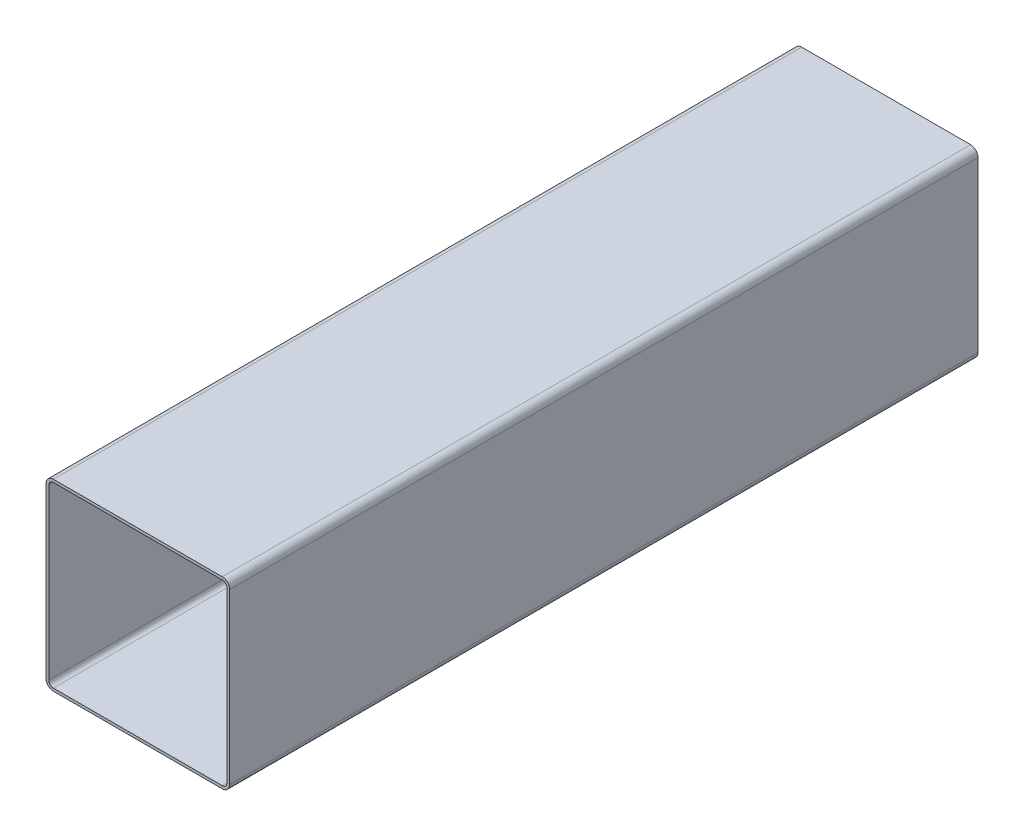
ISO-10303-21;
HEADER;
FILE_DESCRIPTION(('STEP AP214'),'2;1');
FILE_NAME('part.step','',(''),(''),'','','');
FILE_SCHEMA(('AUTOMOTIVE_DESIGN { 1 0 10303 214 1 1 1 1 }'));
ENDSEC;
DATA;
#1=APPLICATION_CONTEXT('core data for automotive mechanical design processes');
#2=APPLICATION_PROTOCOL_DEFINITION('international standard','automotive_design',2000,#1);
#3=PRODUCT_CONTEXT('',#1,'mechanical');
#4=PRODUCT('Part','Part','',(#3));
#5=PRODUCT_RELATED_PRODUCT_CATEGORY('part','',(#4));
#6=PRODUCT_DEFINITION_FORMATION('','',#4);
#7=PRODUCT_DEFINITION_CONTEXT('part definition',#1,'design');
#8=PRODUCT_DEFINITION('design','',#6,#7);
#9=PRODUCT_DEFINITION_SHAPE('','',#8);
#10=(LENGTH_UNIT() NAMED_UNIT(*) SI_UNIT(.MILLI.,.METRE.));
#11=(NAMED_UNIT(*) PLANE_ANGLE_UNIT() SI_UNIT($,.RADIAN.));
#12=(NAMED_UNIT(*) SI_UNIT($,.STERADIAN.) SOLID_ANGLE_UNIT());
#13=UNCERTAINTY_MEASURE_WITH_UNIT(LENGTH_MEASURE(1.E-05),#10,'distance_accuracy_value','');
#14=(GEOMETRIC_REPRESENTATION_CONTEXT(3) GLOBAL_UNCERTAINTY_ASSIGNED_CONTEXT((#13)) GLOBAL_UNIT_ASSIGNED_CONTEXT((#10,
#11,#12)) REPRESENTATION_CONTEXT('',''));
#15=CARTESIAN_POINT('',(0.,0.,0.));
#16=DIRECTION('',(0.,0.,1.));
#17=DIRECTION('',(1.,0.,0.));
#18=AXIS2_PLACEMENT_3D('',#15,#16,#17);
#19=CARTESIAN_POINT('',(-92.,-92.,815.));
#20=DIRECTION('',(0.,0.,1.));
#21=DIRECTION('',(1.,0.,0.));
#22=AXIS2_PLACEMENT_3D('',#19,#20,#21);
#23=PLANE('',#22);
#24=CARTESIAN_POINT('',(-92.,-92.,815.));
#25=DIRECTION('',(0.,0.,1.));
#26=DIRECTION('',(1.,0.,0.));
#27=AXIS2_PLACEMENT_3D('',#24,#25,#26);
#28=CIRCLE('',#27,8.00000000000001);
#29=CARTESIAN_POINT('',(-100.,-92.,815.));
#30=VERTEX_POINT('',#29);
#31=CARTESIAN_POINT('',(-92.,-100.,815.));
#32=VERTEX_POINT('',#31);
#33=EDGE_CURVE('E261',#30,#32,#28,.T.);
#34=ORIENTED_EDGE('',*,*,#33,.T.);
#35=DIRECTION('',(1.,0.,0.));
#36=VECTOR('',#35,1.);
#37=CARTESIAN_POINT('',(92.,-100.,815.));
#38=LINE('',#37,#36);
#39=CARTESIAN_POINT('',(92.,-100.,815.));
#40=VERTEX_POINT('',#39);
#41=EDGE_CURVE('E264',#32,#40,#38,.T.);
#42=ORIENTED_EDGE('',*,*,#41,.T.);
#43=CARTESIAN_POINT('',(92.,-92.,815.));
#44=DIRECTION('',(0.,0.,1.));
#45=DIRECTION('',(1.,0.,0.));
#46=AXIS2_PLACEMENT_3D('',#43,#44,#45);
#47=CIRCLE('',#46,7.99999999999999);
#48=CARTESIAN_POINT('',(100.,-92.,815.));
#49=VERTEX_POINT('',#48);
#50=EDGE_CURVE('E267',#40,#49,#47,.T.);
#51=ORIENTED_EDGE('',*,*,#50,.T.);
#52=DIRECTION('',(0.,1.,0.));
#53=VECTOR('',#52,1.);
#54=CARTESIAN_POINT('',(100.,-92.,815.));
#55=LINE('',#54,#53);
#56=CARTESIAN_POINT('',(100.,92.,815.));
#57=VERTEX_POINT('',#56);
#58=EDGE_CURVE('E269',#49,#57,#55,.T.);
#59=ORIENTED_EDGE('',*,*,#58,.T.);
#60=CARTESIAN_POINT('',(92.,92.,815.));
#61=DIRECTION('',(0.,0.,1.));
#62=DIRECTION('',(1.,0.,0.));
#63=AXIS2_PLACEMENT_3D('',#60,#61,#62);
#64=CIRCLE('',#63,8.00000000000001);
#65=CARTESIAN_POINT('',(92.,100.,815.));
#66=VERTEX_POINT('',#65);
#67=EDGE_CURVE('E271',#57,#66,#64,.T.);
#68=ORIENTED_EDGE('',*,*,#67,.T.);
#69=DIRECTION('',(-1.,0.,0.));
#70=VECTOR('',#69,1.);
#71=CARTESIAN_POINT('',(92.,100.,815.));
#72=LINE('',#71,#70);
#73=CARTESIAN_POINT('',(-92.,100.,815.));
#74=VERTEX_POINT('',#73);
#75=EDGE_CURVE('E273',#66,#74,#72,.T.);
#76=ORIENTED_EDGE('',*,*,#75,.T.);
#77=CARTESIAN_POINT('',(-92.,92.,815.));
#78=DIRECTION('',(0.,0.,1.));
#79=DIRECTION('',(-1.,0.,0.));
#80=AXIS2_PLACEMENT_3D('',#77,#78,#79);
#81=CIRCLE('',#80,8.);
#82=CARTESIAN_POINT('',(-100.,92.,815.));
#83=VERTEX_POINT('',#82);
#84=EDGE_CURVE('E275',#74,#83,#81,.T.);
#85=ORIENTED_EDGE('',*,*,#84,.T.);
#86=DIRECTION('',(0.,-1.,0.));
#87=VECTOR('',#86,1.);
#88=CARTESIAN_POINT('',(-100.,-92.,815.));
#89=LINE('',#88,#87);
#90=EDGE_CURVE('E277',#83,#30,#89,.T.);
#91=ORIENTED_EDGE('',*,*,#90,.T.);
#92=EDGE_LOOP('',(#34,#42,#51,#59,#68,#76,#85,#91));
#93=FACE_BOUND('',#92,.T.);
#94=DIRECTION('',(1.,0.,0.));
#95=VECTOR('',#94,1.);
#96=CARTESIAN_POINT('',(92.,-97.,815.));
#97=LINE('',#96,#95);
#98=CARTESIAN_POINT('',(-92.,-97.,815.));
#99=VERTEX_POINT('',#98);
#100=CARTESIAN_POINT('',(92.,-97.,815.));
#101=VERTEX_POINT('',#100);
#102=EDGE_CURVE('E204',#99,#101,#97,.T.);
#103=ORIENTED_EDGE('',*,*,#102,.F.);
#104=CARTESIAN_POINT('',(-92.,-92.,815.));
#105=DIRECTION('',(0.,0.,1.));
#106=DIRECTION('',(1.,0.,0.));
#107=AXIS2_PLACEMENT_3D('',#104,#105,#106);
#108=CIRCLE('',#107,5.00000000000001);
#109=CARTESIAN_POINT('',(-97.,-92.,815.));
#110=VERTEX_POINT('',#109);
#111=EDGE_CURVE('E196',#110,#99,#108,.T.);
#112=ORIENTED_EDGE('',*,*,#111,.F.);
#113=DIRECTION('',(0.,-1.,0.));
#114=VECTOR('',#113,1.);
#115=CARTESIAN_POINT('',(-97.,-92.,815.));
#116=LINE('',#115,#114);
#117=CARTESIAN_POINT('',(-97.,92.,815.));
#118=VERTEX_POINT('',#117);
#119=EDGE_CURVE('E229',#118,#110,#116,.T.);
#120=ORIENTED_EDGE('',*,*,#119,.F.);
#121=CARTESIAN_POINT('',(-92.,92.,815.));
#122=DIRECTION('',(0.,0.,1.));
#123=DIRECTION('',(1.,0.,0.));
#124=AXIS2_PLACEMENT_3D('',#121,#122,#123);
#125=CIRCLE('',#124,5.);
#126=CARTESIAN_POINT('',(-92.,97.,815.));
#127=VERTEX_POINT('',#126);
#128=EDGE_CURVE('E227',#127,#118,#125,.T.);
#129=ORIENTED_EDGE('',*,*,#128,.F.);
#130=DIRECTION('',(-1.,0.,0.));
#131=VECTOR('',#130,1.);
#132=CARTESIAN_POINT('',(92.,97.,815.));
#133=LINE('',#132,#131);
#134=CARTESIAN_POINT('',(92.,97.,815.));
#135=VERTEX_POINT('',#134);
#136=EDGE_CURVE('E225',#135,#127,#133,.T.);
#137=ORIENTED_EDGE('',*,*,#136,.F.);
#138=CARTESIAN_POINT('',(92.,92.,815.));
#139=DIRECTION('',(0.,0.,1.));
#140=DIRECTION('',(1.,0.,0.));
#141=AXIS2_PLACEMENT_3D('',#138,#139,#140);
#142=CIRCLE('',#141,5.00000000000001);
#143=CARTESIAN_POINT('',(97.,92.,815.));
#144=VERTEX_POINT('',#143);
#145=EDGE_CURVE('E223',#144,#135,#142,.T.);
#146=ORIENTED_EDGE('',*,*,#145,.F.);
#147=DIRECTION('',(0.,1.,0.));
#148=VECTOR('',#147,1.);
#149=CARTESIAN_POINT('',(97.,-92.,815.));
#150=LINE('',#149,#148);
#151=CARTESIAN_POINT('',(97.,-92.,815.));
#152=VERTEX_POINT('',#151);
#153=EDGE_CURVE('E219',#152,#144,#150,.T.);
#154=ORIENTED_EDGE('',*,*,#153,.F.);
#155=CARTESIAN_POINT('',(92.,-92.,815.));
#156=DIRECTION('',(0.,0.,1.));
#157=DIRECTION('',(1.,0.,0.));
#158=AXIS2_PLACEMENT_3D('',#155,#156,#157);
#159=CIRCLE('',#158,4.99999999999999);
#160=EDGE_CURVE('E217',#101,#152,#159,.T.);
#161=ORIENTED_EDGE('',*,*,#160,.F.);
#162=EDGE_LOOP('',(#103,#112,#120,#129,#137,#146,#154,#161));
#163=FACE_BOUND('',#162,.T.);
#164=ADVANCED_FACE('F83',(#93,#163),#23,.T.);
#165=CARTESIAN_POINT('',(-92.,-92.,0.));
#166=DIRECTION('',(0.,0.,1.));
#167=DIRECTION('',(1.,0.,0.));
#168=AXIS2_PLACEMENT_3D('',#165,#166,#167);
#169=PLANE('',#168);
#170=CARTESIAN_POINT('',(-92.,-92.,0.));
#171=DIRECTION('',(0.,0.,1.));
#172=DIRECTION('',(1.,0.,0.));
#173=AXIS2_PLACEMENT_3D('',#170,#171,#172);
#174=CIRCLE('',#173,8.00000000000001);
#175=CARTESIAN_POINT('',(-100.,-92.,0.));
#176=VERTEX_POINT('',#175);
#177=CARTESIAN_POINT('',(-92.,-100.,0.));
#178=VERTEX_POINT('',#177);
#179=EDGE_CURVE('E212',#176,#178,#174,.T.);
#180=ORIENTED_EDGE('',*,*,#179,.F.);
#181=DIRECTION('',(0.,-1.,0.));
#182=VECTOR('',#181,1.);
#183=CARTESIAN_POINT('',(-100.,-92.,0.));
#184=LINE('',#183,#182);
#185=CARTESIAN_POINT('',(-100.,92.,0.));
#186=VERTEX_POINT('',#185);
#187=EDGE_CURVE('E265',#186,#176,#184,.T.);
#188=ORIENTED_EDGE('',*,*,#187,.F.);
#189=CARTESIAN_POINT('',(-92.,92.,0.));
#190=DIRECTION('',(0.,0.,1.));
#191=DIRECTION('',(-1.,0.,0.));
#192=AXIS2_PLACEMENT_3D('',#189,#190,#191);
#193=CIRCLE('',#192,8.);
#194=CARTESIAN_POINT('',(-92.,100.,0.));
#195=VERTEX_POINT('',#194);
#196=EDGE_CURVE('E292',#195,#186,#193,.T.);
#197=ORIENTED_EDGE('',*,*,#196,.F.);
#198=DIRECTION('',(-1.,0.,0.));
#199=VECTOR('',#198,1.);
#200=CARTESIAN_POINT('',(92.,100.,0.));
#201=LINE('',#200,#199);
#202=CARTESIAN_POINT('',(92.,100.,0.));
#203=VERTEX_POINT('',#202);
#204=EDGE_CURVE('E290',#203,#195,#201,.T.);
#205=ORIENTED_EDGE('',*,*,#204,.F.);
#206=CARTESIAN_POINT('',(92.,92.,0.));
#207=DIRECTION('',(0.,0.,1.));
#208=DIRECTION('',(1.,0.,0.));
#209=AXIS2_PLACEMENT_3D('',#206,#207,#208);
#210=CIRCLE('',#209,8.00000000000001);
#211=CARTESIAN_POINT('',(100.,92.,0.));
#212=VERTEX_POINT('',#211);
#213=EDGE_CURVE('E288',#212,#203,#210,.T.);
#214=ORIENTED_EDGE('',*,*,#213,.F.);
#215=DIRECTION('',(0.,1.,0.));
#216=VECTOR('',#215,1.);
#217=CARTESIAN_POINT('',(100.,-92.,0.));
#218=LINE('',#217,#216);
#219=CARTESIAN_POINT('',(100.,-92.,0.));
#220=VERTEX_POINT('',#219);
#221=EDGE_CURVE('E286',#220,#212,#218,.T.);
#222=ORIENTED_EDGE('',*,*,#221,.F.);
#223=CARTESIAN_POINT('',(92.,-92.,0.));
#224=DIRECTION('',(0.,0.,1.));
#225=DIRECTION('',(1.,0.,0.));
#226=AXIS2_PLACEMENT_3D('',#223,#224,#225);
#227=CIRCLE('',#226,7.99999999999999);
#228=CARTESIAN_POINT('',(92.,-100.,0.));
#229=VERTEX_POINT('',#228);
#230=EDGE_CURVE('E284',#229,#220,#227,.T.);
#231=ORIENTED_EDGE('',*,*,#230,.F.);
#232=DIRECTION('',(1.,0.,0.));
#233=VECTOR('',#232,1.);
#234=CARTESIAN_POINT('',(92.,-100.,0.));
#235=LINE('',#234,#233);
#236=EDGE_CURVE('E282',#178,#229,#235,.T.);
#237=ORIENTED_EDGE('',*,*,#236,.F.);
#238=EDGE_LOOP('',(#180,#188,#197,#205,#214,#222,#231,#237));
#239=FACE_BOUND('',#238,.T.);
#240=CARTESIAN_POINT('',(-92.,-92.,0.));
#241=DIRECTION('',(0.,0.,1.));
#242=DIRECTION('',(1.,0.,0.));
#243=AXIS2_PLACEMENT_3D('',#240,#241,#242);
#244=CIRCLE('',#243,5.00000000000001);
#245=CARTESIAN_POINT('',(-97.,-92.,0.));
#246=VERTEX_POINT('',#245);
#247=CARTESIAN_POINT('',(-92.,-97.,0.));
#248=VERTEX_POINT('',#247);
#249=EDGE_CURVE('E106',#246,#248,#244,.T.);
#250=ORIENTED_EDGE('',*,*,#249,.T.);
#251=DIRECTION('',(1.,0.,0.));
#252=VECTOR('',#251,1.);
#253=CARTESIAN_POINT('',(92.,-97.,0.));
#254=LINE('',#253,#252);
#255=CARTESIAN_POINT('',(92.,-97.,0.));
#256=VERTEX_POINT('',#255);
#257=EDGE_CURVE('E211',#248,#256,#254,.T.);
#258=ORIENTED_EDGE('',*,*,#257,.T.);
#259=CARTESIAN_POINT('',(92.,-92.,0.));
#260=DIRECTION('',(0.,0.,1.));
#261=DIRECTION('',(1.,0.,0.));
#262=AXIS2_PLACEMENT_3D('',#259,#260,#261);
#263=CIRCLE('',#262,4.99999999999999);
#264=CARTESIAN_POINT('',(97.,-92.,0.));
#265=VERTEX_POINT('',#264);
#266=EDGE_CURVE('E233',#256,#265,#263,.T.);
#267=ORIENTED_EDGE('',*,*,#266,.T.);
#268=DIRECTION('',(0.,1.,0.));
#269=VECTOR('',#268,1.);
#270=CARTESIAN_POINT('',(97.,-92.,0.));
#271=LINE('',#270,#269);
#272=CARTESIAN_POINT('',(97.,92.,0.));
#273=VERTEX_POINT('',#272);
#274=EDGE_CURVE('E236',#265,#273,#271,.T.);
#275=ORIENTED_EDGE('',*,*,#274,.T.);
#276=CARTESIAN_POINT('',(92.,92.,0.));
#277=DIRECTION('',(0.,0.,1.));
#278=DIRECTION('',(1.,0.,0.));
#279=AXIS2_PLACEMENT_3D('',#276,#277,#278);
#280=CIRCLE('',#279,5.00000000000001);
#281=CARTESIAN_POINT('',(92.,97.,0.));
#282=VERTEX_POINT('',#281);
#283=EDGE_CURVE('E239',#273,#282,#280,.T.);
#284=ORIENTED_EDGE('',*,*,#283,.T.);
#285=DIRECTION('',(-1.,0.,0.));
#286=VECTOR('',#285,1.);
#287=CARTESIAN_POINT('',(92.,97.,0.));
#288=LINE('',#287,#286);
#289=CARTESIAN_POINT('',(-92.,97.,0.));
#290=VERTEX_POINT('',#289);
#291=EDGE_CURVE('E242',#282,#290,#288,.T.);
#292=ORIENTED_EDGE('',*,*,#291,.T.);
#293=CARTESIAN_POINT('',(-92.,92.,0.));
#294=DIRECTION('',(0.,0.,1.));
#295=DIRECTION('',(1.,0.,0.));
#296=AXIS2_PLACEMENT_3D('',#293,#294,#295);
#297=CIRCLE('',#296,5.);
#298=CARTESIAN_POINT('',(-97.,92.,0.));
#299=VERTEX_POINT('',#298);
#300=EDGE_CURVE('E245',#290,#299,#297,.T.);
#301=ORIENTED_EDGE('',*,*,#300,.T.);
#302=DIRECTION('',(0.,-1.,0.));
#303=VECTOR('',#302,1.);
#304=CARTESIAN_POINT('',(-97.,-92.,0.));
#305=LINE('',#304,#303);
#306=EDGE_CURVE('E205',#299,#246,#305,.T.);
#307=ORIENTED_EDGE('',*,*,#306,.T.);
#308=EDGE_LOOP('',(#250,#258,#267,#275,#284,#292,#301,#307));
#309=FACE_BOUND('',#308,.T.);
#310=ADVANCED_FACE('F322',(#239,#309),#169,.F.);
#311=CARTESIAN_POINT('',(-92.,-92.,815.));
#312=DIRECTION('',(0.,0.,-1.));
#313=DIRECTION('',(-1.,0.,0.));
#314=AXIS2_PLACEMENT_3D('',#311,#312,#313);
#315=CYLINDRICAL_SURFACE('',#314,8.00000000000001);
#316=ORIENTED_EDGE('',*,*,#179,.T.);
#317=DIRECTION('',(0.,0.,-1.));
#318=VECTOR('',#317,1.);
#319=CARTESIAN_POINT('',(-92.,-100.,815.));
#320=LINE('',#319,#318);
#321=EDGE_CURVE('E12',#32,#178,#320,.T.);
#322=ORIENTED_EDGE('',*,*,#321,.F.);
#323=ORIENTED_EDGE('',*,*,#33,.F.);
#324=DIRECTION('',(0.,0.,-1.));
#325=VECTOR('',#324,1.);
#326=CARTESIAN_POINT('',(-100.,-92.,815.));
#327=LINE('',#326,#325);
#328=EDGE_CURVE('E279',#30,#176,#327,.T.);
#329=ORIENTED_EDGE('',*,*,#328,.T.);
#330=EDGE_LOOP('',(#316,#322,#323,#329));
#331=FACE_BOUND('',#330,.T.);
#332=ADVANCED_FACE('F85',(#331),#315,.T.);
#333=CARTESIAN_POINT('',(92.,-100.,815.));
#334=DIRECTION('',(0.,1.,0.));
#335=DIRECTION('',(-1.,0.,0.));
#336=AXIS2_PLACEMENT_3D('',#333,#334,#335);
#337=PLANE('',#336);
#338=ORIENTED_EDGE('',*,*,#236,.T.);
#339=DIRECTION('',(0.,0.,-1.));
#340=VECTOR('',#339,1.);
#341=CARTESIAN_POINT('',(92.,-100.,815.));
#342=LINE('',#341,#340);
#343=EDGE_CURVE('E91',#40,#229,#342,.T.);
#344=ORIENTED_EDGE('',*,*,#343,.F.);
#345=ORIENTED_EDGE('',*,*,#41,.F.);
#346=ORIENTED_EDGE('',*,*,#321,.T.);
#347=EDGE_LOOP('',(#338,#344,#345,#346));
#348=FACE_BOUND('',#347,.T.);
#349=ADVANCED_FACE('F339',(#348),#337,.F.);
#350=CARTESIAN_POINT('',(92.,-92.,815.));
#351=DIRECTION('',(0.,0.,-1.));
#352=DIRECTION('',(-1.,0.,0.));
#353=AXIS2_PLACEMENT_3D('',#350,#351,#352);
#354=CYLINDRICAL_SURFACE('',#353,7.99999999999999);
#355=ORIENTED_EDGE('',*,*,#230,.T.);
#356=DIRECTION('',(0.,0.,-1.));
#357=VECTOR('',#356,1.);
#358=CARTESIAN_POINT('',(100.,-92.,815.));
#359=LINE('',#358,#357);
#360=EDGE_CURVE('E309',#49,#220,#359,.T.);
#361=ORIENTED_EDGE('',*,*,#360,.F.);
#362=ORIENTED_EDGE('',*,*,#50,.F.);
#363=ORIENTED_EDGE('',*,*,#343,.T.);
#364=EDGE_LOOP('',(#355,#361,#362,#363));
#365=FACE_BOUND('',#364,.T.);
#366=ADVANCED_FACE('F316',(#365),#354,.T.);
#367=CARTESIAN_POINT('',(100.,-92.,815.));
#368=DIRECTION('',(-1.,0.,0.));
#369=DIRECTION('',(0.,0.,1.));
#370=AXIS2_PLACEMENT_3D('',#367,#368,#369);
#371=PLANE('',#370);
#372=ORIENTED_EDGE('',*,*,#221,.T.);
#373=DIRECTION('',(0.,0.,-1.));
#374=VECTOR('',#373,1.);
#375=CARTESIAN_POINT('',(100.,92.,815.));
#376=LINE('',#375,#374);
#377=EDGE_CURVE('E306',#57,#212,#376,.T.);
#378=ORIENTED_EDGE('',*,*,#377,.F.);
#379=ORIENTED_EDGE('',*,*,#58,.F.);
#380=ORIENTED_EDGE('',*,*,#360,.T.);
#381=EDGE_LOOP('',(#372,#378,#379,#380));
#382=FACE_BOUND('',#381,.T.);
#383=ADVANCED_FACE('F328',(#382),#371,.F.);
#384=CARTESIAN_POINT('',(92.,92.,815.));
#385=DIRECTION('',(0.,0.,-1.));
#386=DIRECTION('',(-1.,0.,0.));
#387=AXIS2_PLACEMENT_3D('',#384,#385,#386);
#388=CYLINDRICAL_SURFACE('',#387,8.00000000000001);
#389=ORIENTED_EDGE('',*,*,#213,.T.);
#390=DIRECTION('',(0.,0.,-1.));
#391=VECTOR('',#390,1.);
#392=CARTESIAN_POINT('',(92.,100.,815.));
#393=LINE('',#392,#391);
#394=EDGE_CURVE('E303',#66,#203,#393,.T.);
#395=ORIENTED_EDGE('',*,*,#394,.F.);
#396=ORIENTED_EDGE('',*,*,#67,.F.);
#397=ORIENTED_EDGE('',*,*,#377,.T.);
#398=EDGE_LOOP('',(#389,#395,#396,#397));
#399=FACE_BOUND('',#398,.T.);
#400=ADVANCED_FACE('F332',(#399),#388,.T.);
#401=CARTESIAN_POINT('',(92.,100.,815.));
#402=DIRECTION('',(0.,-1.,0.));
#403=DIRECTION('',(1.,0.,0.));
#404=AXIS2_PLACEMENT_3D('',#401,#402,#403);
#405=PLANE('',#404);
#406=ORIENTED_EDGE('',*,*,#204,.T.);
#407=DIRECTION('',(0.,0.,-1.));
#408=VECTOR('',#407,1.);
#409=CARTESIAN_POINT('',(-92.,100.,815.));
#410=LINE('',#409,#408);
#411=EDGE_CURVE('E300',#74,#195,#410,.T.);
#412=ORIENTED_EDGE('',*,*,#411,.F.);
#413=ORIENTED_EDGE('',*,*,#75,.F.);
#414=ORIENTED_EDGE('',*,*,#394,.T.);
#415=EDGE_LOOP('',(#406,#412,#413,#414));
#416=FACE_BOUND('',#415,.T.);
#417=ADVANCED_FACE('F352',(#416),#405,.F.);
#418=CARTESIAN_POINT('',(-92.,92.,815.));
#419=DIRECTION('',(0.,0.,-1.));
#420=DIRECTION('',(-1.,0.,0.));
#421=AXIS2_PLACEMENT_3D('',#418,#419,#420);
#422=CYLINDRICAL_SURFACE('',#421,8.);
#423=ORIENTED_EDGE('',*,*,#196,.T.);
#424=DIRECTION('',(0.,0.,-1.));
#425=VECTOR('',#424,1.);
#426=CARTESIAN_POINT('',(-100.,92.,815.));
#427=LINE('',#426,#425);
#428=EDGE_CURVE('E297',#83,#186,#427,.T.);
#429=ORIENTED_EDGE('',*,*,#428,.F.);
#430=ORIENTED_EDGE('',*,*,#84,.F.);
#431=ORIENTED_EDGE('',*,*,#411,.T.);
#432=EDGE_LOOP('',(#423,#429,#430,#431));
#433=FACE_BOUND('',#432,.T.);
#434=ADVANCED_FACE('F350',(#433),#422,.T.);
#435=CARTESIAN_POINT('',(-100.,-92.,815.));
#436=DIRECTION('',(1.,0.,0.));
#437=DIRECTION('',(0.,1.,0.));
#438=AXIS2_PLACEMENT_3D('',#435,#436,#437);
#439=PLANE('',#438);
#440=ORIENTED_EDGE('',*,*,#187,.T.);
#441=ORIENTED_EDGE('',*,*,#328,.F.);
#442=ORIENTED_EDGE('',*,*,#90,.F.);
#443=ORIENTED_EDGE('',*,*,#428,.T.);
#444=EDGE_LOOP('',(#440,#441,#442,#443));
#445=FACE_BOUND('',#444,.T.);
#446=ADVANCED_FACE('F345',(#445),#439,.F.);
#447=CARTESIAN_POINT('',(-92.,-92.,815.));
#448=DIRECTION('',(0.,0.,-1.));
#449=DIRECTION('',(-1.,0.,0.));
#450=AXIS2_PLACEMENT_3D('',#447,#448,#449);
#451=CYLINDRICAL_SURFACE('',#450,5.00000000000001);
#452=ORIENTED_EDGE('',*,*,#249,.F.);
#453=DIRECTION('',(0.,0.,-1.));
#454=VECTOR('',#453,1.);
#455=CARTESIAN_POINT('',(-97.,-92.,815.));
#456=LINE('',#455,#454);
#457=EDGE_CURVE('E200',#110,#246,#456,.T.);
#458=ORIENTED_EDGE('',*,*,#457,.F.);
#459=ORIENTED_EDGE('',*,*,#111,.T.);
#460=DIRECTION('',(0.,0.,-1.));
#461=VECTOR('',#460,1.);
#462=CARTESIAN_POINT('',(-92.,-97.,815.));
#463=LINE('',#462,#461);
#464=EDGE_CURVE('E199',#99,#248,#463,.T.);
#465=ORIENTED_EDGE('',*,*,#464,.T.);
#466=EDGE_LOOP('',(#452,#458,#459,#465));
#467=FACE_BOUND('',#466,.T.);
#468=ADVANCED_FACE('F198',(#467),#451,.F.);
#469=CARTESIAN_POINT('',(92.,-97.,815.));
#470=DIRECTION('',(0.,1.,0.));
#471=DIRECTION('',(-1.,0.,0.));
#472=AXIS2_PLACEMENT_3D('',#469,#470,#471);
#473=PLANE('',#472);
#474=ORIENTED_EDGE('',*,*,#257,.F.);
#475=ORIENTED_EDGE('',*,*,#464,.F.);
#476=ORIENTED_EDGE('',*,*,#102,.T.);
#477=DIRECTION('',(0.,0.,-1.));
#478=VECTOR('',#477,1.);
#479=CARTESIAN_POINT('',(92.,-97.,815.));
#480=LINE('',#479,#478);
#481=EDGE_CURVE('E213',#101,#256,#480,.T.);
#482=ORIENTED_EDGE('',*,*,#481,.T.);
#483=EDGE_LOOP('',(#474,#475,#476,#482));
#484=FACE_BOUND('',#483,.T.);
#485=ADVANCED_FACE('F208',(#484),#473,.T.);
#486=CARTESIAN_POINT('',(92.,-92.,815.));
#487=DIRECTION('',(0.,0.,-1.));
#488=DIRECTION('',(-1.,0.,0.));
#489=AXIS2_PLACEMENT_3D('',#486,#487,#488);
#490=CYLINDRICAL_SURFACE('',#489,4.99999999999999);
#491=ORIENTED_EDGE('',*,*,#266,.F.);
#492=ORIENTED_EDGE('',*,*,#481,.F.);
#493=ORIENTED_EDGE('',*,*,#160,.T.);
#494=DIRECTION('',(0.,0.,-1.));
#495=VECTOR('',#494,1.);
#496=CARTESIAN_POINT('',(97.,-92.,815.));
#497=LINE('',#496,#495);
#498=EDGE_CURVE('E258',#152,#265,#497,.T.);
#499=ORIENTED_EDGE('',*,*,#498,.T.);
#500=EDGE_LOOP('',(#491,#492,#493,#499));
#501=FACE_BOUND('',#500,.T.);
#502=ADVANCED_FACE('F377',(#501),#490,.F.);
#503=CARTESIAN_POINT('',(97.,-92.,815.));
#504=DIRECTION('',(-1.,0.,0.));
#505=DIRECTION('',(0.,0.,1.));
#506=AXIS2_PLACEMENT_3D('',#503,#504,#505);
#507=PLANE('',#506);
#508=ORIENTED_EDGE('',*,*,#274,.F.);
#509=ORIENTED_EDGE('',*,*,#498,.F.);
#510=ORIENTED_EDGE('',*,*,#153,.T.);
#511=DIRECTION('',(0.,0.,-1.));
#512=VECTOR('',#511,1.);
#513=CARTESIAN_POINT('',(97.,92.,815.));
#514=LINE('',#513,#512);
#515=EDGE_CURVE('E256',#144,#273,#514,.T.);
#516=ORIENTED_EDGE('',*,*,#515,.T.);
#517=EDGE_LOOP('',(#508,#509,#510,#516));
#518=FACE_BOUND('',#517,.T.);
#519=ADVANCED_FACE('F381',(#518),#507,.T.);
#520=CARTESIAN_POINT('',(92.,92.,815.));
#521=DIRECTION('',(0.,0.,-1.));
#522=DIRECTION('',(-1.,0.,0.));
#523=AXIS2_PLACEMENT_3D('',#520,#521,#522);
#524=CYLINDRICAL_SURFACE('',#523,5.00000000000001);
#525=ORIENTED_EDGE('',*,*,#283,.F.);
#526=ORIENTED_EDGE('',*,*,#515,.F.);
#527=ORIENTED_EDGE('',*,*,#145,.T.);
#528=DIRECTION('',(0.,0.,-1.));
#529=VECTOR('',#528,1.);
#530=CARTESIAN_POINT('',(92.,97.,815.));
#531=LINE('',#530,#529);
#532=EDGE_CURVE('E254',#135,#282,#531,.T.);
#533=ORIENTED_EDGE('',*,*,#532,.T.);
#534=EDGE_LOOP('',(#525,#526,#527,#533));
#535=FACE_BOUND('',#534,.T.);
#536=ADVANCED_FACE('F387',(#535),#524,.F.);
#537=CARTESIAN_POINT('',(92.,97.,815.));
#538=DIRECTION('',(0.,-1.,0.));
#539=DIRECTION('',(1.,0.,0.));
#540=AXIS2_PLACEMENT_3D('',#537,#538,#539);
#541=PLANE('',#540);
#542=ORIENTED_EDGE('',*,*,#291,.F.);
#543=ORIENTED_EDGE('',*,*,#532,.F.);
#544=ORIENTED_EDGE('',*,*,#136,.T.);
#545=DIRECTION('',(0.,0.,-1.));
#546=VECTOR('',#545,1.);
#547=CARTESIAN_POINT('',(-92.,97.,815.));
#548=LINE('',#547,#546);
#549=EDGE_CURVE('E252',#127,#290,#548,.T.);
#550=ORIENTED_EDGE('',*,*,#549,.T.);
#551=EDGE_LOOP('',(#542,#543,#544,#550));
#552=FACE_BOUND('',#551,.T.);
#553=ADVANCED_FACE('F391',(#552),#541,.T.);
#554=CARTESIAN_POINT('',(-92.,92.,815.));
#555=DIRECTION('',(0.,0.,-1.));
#556=DIRECTION('',(-1.,0.,0.));
#557=AXIS2_PLACEMENT_3D('',#554,#555,#556);
#558=CYLINDRICAL_SURFACE('',#557,5.);
#559=ORIENTED_EDGE('',*,*,#300,.F.);
#560=ORIENTED_EDGE('',*,*,#549,.F.);
#561=ORIENTED_EDGE('',*,*,#128,.T.);
#562=DIRECTION('',(0.,0.,-1.));
#563=VECTOR('',#562,1.);
#564=CARTESIAN_POINT('',(-97.,92.,815.));
#565=LINE('',#564,#563);
#566=EDGE_CURVE('E98',#118,#299,#565,.T.);
#567=ORIENTED_EDGE('',*,*,#566,.T.);
#568=EDGE_LOOP('',(#559,#560,#561,#567));
#569=FACE_BOUND('',#568,.T.);
#570=ADVANCED_FACE('F395',(#569),#558,.F.);
#571=CARTESIAN_POINT('',(-97.,-92.,815.));
#572=DIRECTION('',(1.,0.,0.));
#573=DIRECTION('',(0.,1.,0.));
#574=AXIS2_PLACEMENT_3D('',#571,#572,#573);
#575=PLANE('',#574);
#576=ORIENTED_EDGE('',*,*,#306,.F.);
#577=ORIENTED_EDGE('',*,*,#566,.F.);
#578=ORIENTED_EDGE('',*,*,#119,.T.);
#579=ORIENTED_EDGE('',*,*,#457,.T.);
#580=EDGE_LOOP('',(#576,#577,#578,#579));
#581=FACE_BOUND('',#580,.T.);
#582=ADVANCED_FACE('F399',(#581),#575,.T.);
#583=CLOSED_SHELL('',(#164,#310,#332,#349,#366,#383,#400,#417,#434,#446,#468,#485,#502,#519,
#536,#553,#570,#582));
#584=MANIFOLD_SOLID_BREP('B2',#583);
#585=ADVANCED_BREP_SHAPE_REPRESENTATION('',(#18,#584),#14);
#586=SHAPE_DEFINITION_REPRESENTATION(#9,#585);
ENDSEC;
END-ISO-10303-21;
